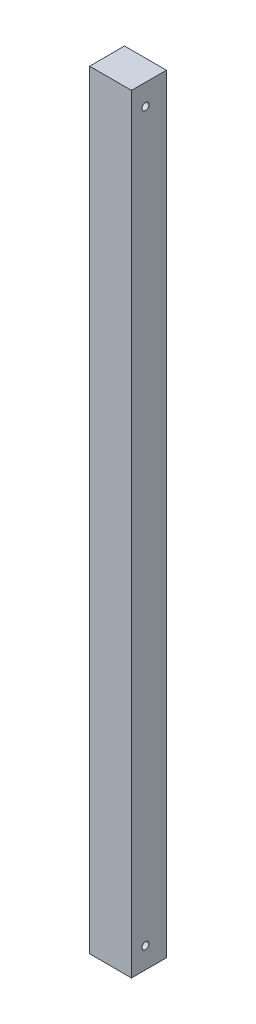
ISO-10303-21;
HEADER;
FILE_DESCRIPTION(('STEP AP214'),'2;1');
FILE_NAME('part.step','',(''),(''),'','','');
FILE_SCHEMA(('AUTOMOTIVE_DESIGN { 1 0 10303 214 1 1 1 1 }'));
ENDSEC;
DATA;
#1=APPLICATION_CONTEXT('core data for automotive mechanical design processes');
#2=APPLICATION_PROTOCOL_DEFINITION('international standard','automotive_design',2000,#1);
#3=PRODUCT_CONTEXT('',#1,'mechanical');
#4=PRODUCT('Part','Part','',(#3));
#5=PRODUCT_RELATED_PRODUCT_CATEGORY('part','',(#4));
#6=PRODUCT_DEFINITION_FORMATION('','',#4);
#7=PRODUCT_DEFINITION_CONTEXT('part definition',#1,'design');
#8=PRODUCT_DEFINITION('design','',#6,#7);
#9=PRODUCT_DEFINITION_SHAPE('','',#8);
#10=(LENGTH_UNIT() NAMED_UNIT(*) SI_UNIT(.MILLI.,.METRE.));
#11=(NAMED_UNIT(*) PLANE_ANGLE_UNIT() SI_UNIT($,.RADIAN.));
#12=(NAMED_UNIT(*) SI_UNIT($,.STERADIAN.) SOLID_ANGLE_UNIT());
#13=UNCERTAINTY_MEASURE_WITH_UNIT(LENGTH_MEASURE(1.E-05),#10,'distance_accuracy_value','');
#14=(GEOMETRIC_REPRESENTATION_CONTEXT(3) GLOBAL_UNCERTAINTY_ASSIGNED_CONTEXT((#13)) GLOBAL_UNIT_ASSIGNED_CONTEXT((#10,
#11,#12)) REPRESENTATION_CONTEXT('',''));
#15=CARTESIAN_POINT('',(0.,0.,0.));
#16=DIRECTION('',(0.,0.,1.));
#17=DIRECTION('',(1.,0.,0.));
#18=AXIS2_PLACEMENT_3D('',#15,#16,#17);
#19=CARTESIAN_POINT('',(30.,550.,-5.));
#20=DIRECTION('',(-1.,0.,0.));
#21=DIRECTION('',(0.,0.,1.));
#22=AXIS2_PLACEMENT_3D('',#19,#20,#21);
#23=PLANE('',#22);
#24=CARTESIAN_POINT('',(30.,15.,-15.));
#25=DIRECTION('',(1.,0.,0.));
#26=DIRECTION('',(0.,0.,-1.));
#27=AXIS2_PLACEMENT_3D('',#24,#25,#26);
#28=CIRCLE('',#27,2.5);
#29=CARTESIAN_POINT('',(30.,15.,-17.5));
#30=VERTEX_POINT('',#29);
#31=EDGE_CURVE('E119',#30,#30,#28,.T.);
#32=ORIENTED_EDGE('',*,*,#31,.F.);
#33=EDGE_LOOP('',(#32));
#34=FACE_BOUND('',#33,.T.);
#35=CARTESIAN_POINT('',(30.,535.,-15.));
#36=DIRECTION('',(1.,0.,0.));
#37=DIRECTION('',(0.,0.,1.));
#38=AXIS2_PLACEMENT_3D('',#35,#36,#37);
#39=CIRCLE('',#38,2.5);
#40=CARTESIAN_POINT('',(30.,535.,-12.5));
#41=VERTEX_POINT('',#40);
#42=EDGE_CURVE('E113',#41,#41,#39,.T.);
#43=ORIENTED_EDGE('',*,*,#42,.F.);
#44=EDGE_LOOP('',(#43));
#45=FACE_BOUND('',#44,.T.);
#46=DIRECTION('',(0.,0.,-1.));
#47=VECTOR('',#46,1.);
#48=CARTESIAN_POINT('',(30.,0.,-5.));
#49=LINE('',#48,#47);
#50=CARTESIAN_POINT('',(30.,0.,-5.));
#51=VERTEX_POINT('',#50);
#52=CARTESIAN_POINT('',(30.,0.,-30.));
#53=VERTEX_POINT('',#52);
#54=EDGE_CURVE('E99',#51,#53,#49,.T.);
#55=ORIENTED_EDGE('',*,*,#54,.T.);
#56=DIRECTION('',(0.,-1.,0.));
#57=VECTOR('',#56,1.);
#58=CARTESIAN_POINT('',(30.,550.,-30.));
#59=LINE('',#58,#57);
#60=CARTESIAN_POINT('',(30.,550.,-30.));
#61=VERTEX_POINT('',#60);
#62=EDGE_CURVE('E11',#61,#53,#59,.T.);
#63=ORIENTED_EDGE('',*,*,#62,.F.);
#64=DIRECTION('',(0.,0.,-1.));
#65=VECTOR('',#64,1.);
#66=CARTESIAN_POINT('',(30.,550.,-5.));
#67=LINE('',#66,#65);
#68=CARTESIAN_POINT('',(30.,550.,-5.));
#69=VERTEX_POINT('',#68);
#70=EDGE_CURVE('E87',#69,#61,#67,.T.);
#71=ORIENTED_EDGE('',*,*,#70,.F.);
#72=DIRECTION('',(0.,-1.,0.));
#73=VECTOR('',#72,1.);
#74=CARTESIAN_POINT('',(30.,550.,-5.));
#75=LINE('',#74,#73);
#76=EDGE_CURVE('E95',#69,#51,#75,.T.);
#77=ORIENTED_EDGE('',*,*,#76,.T.);
#78=EDGE_LOOP('',(#55,#63,#71,#77));
#79=FACE_BOUND('',#78,.T.);
#80=ADVANCED_FACE('F36',(#34,#45,#79),#23,.F.);
#81=CARTESIAN_POINT('',(0.,550.,-30.));
#82=DIRECTION('',(0.,0.,1.));
#83=DIRECTION('',(1.,0.,0.));
#84=AXIS2_PLACEMENT_3D('',#81,#82,#83);
#85=PLANE('',#84);
#86=DIRECTION('',(-1.,0.,0.));
#87=VECTOR('',#86,1.);
#88=CARTESIAN_POINT('',(0.,0.,-30.));
#89=LINE('',#88,#87);
#90=CARTESIAN_POINT('',(0.,0.,-30.));
#91=VERTEX_POINT('',#90);
#92=EDGE_CURVE('E91',#53,#91,#89,.T.);
#93=ORIENTED_EDGE('',*,*,#92,.T.);
#94=DIRECTION('',(0.,-1.,0.));
#95=VECTOR('',#94,1.);
#96=CARTESIAN_POINT('',(0.,550.,-30.));
#97=LINE('',#96,#95);
#98=CARTESIAN_POINT('',(0.,550.,-30.));
#99=VERTEX_POINT('',#98);
#100=EDGE_CURVE('E44',#99,#91,#97,.T.);
#101=ORIENTED_EDGE('',*,*,#100,.F.);
#102=DIRECTION('',(-1.,0.,0.));
#103=VECTOR('',#102,1.);
#104=CARTESIAN_POINT('',(0.,550.,-30.));
#105=LINE('',#104,#103);
#106=EDGE_CURVE('E82',#61,#99,#105,.T.);
#107=ORIENTED_EDGE('',*,*,#106,.F.);
#108=ORIENTED_EDGE('',*,*,#62,.T.);
#109=EDGE_LOOP('',(#93,#101,#107,#108));
#110=FACE_BOUND('',#109,.T.);
#111=ADVANCED_FACE('F90',(#110),#85,.F.);
#112=CARTESIAN_POINT('',(0.,550.,-5.));
#113=DIRECTION('',(1.,0.,0.));
#114=DIRECTION('',(0.,0.,-1.));
#115=AXIS2_PLACEMENT_3D('',#112,#113,#114);
#116=PLANE('',#115);
#117=CARTESIAN_POINT('',(0.,15.,-15.));
#118=DIRECTION('',(1.,0.,0.));
#119=DIRECTION('',(0.,0.,-1.));
#120=AXIS2_PLACEMENT_3D('',#117,#118,#119);
#121=CIRCLE('',#120,2.5);
#122=CARTESIAN_POINT('',(0.,15.,-17.5));
#123=VERTEX_POINT('',#122);
#124=EDGE_CURVE('E102',#123,#123,#121,.T.);
#125=ORIENTED_EDGE('',*,*,#124,.T.);
#126=EDGE_LOOP('',(#125));
#127=FACE_BOUND('',#126,.T.);
#128=CARTESIAN_POINT('',(0.,535.,-15.));
#129=DIRECTION('',(1.,0.,0.));
#130=DIRECTION('',(0.,0.,1.));
#131=AXIS2_PLACEMENT_3D('',#128,#129,#130);
#132=CIRCLE('',#131,2.5);
#133=CARTESIAN_POINT('',(0.,535.,-12.5));
#134=VERTEX_POINT('',#133);
#135=EDGE_CURVE('E116',#134,#134,#132,.T.);
#136=ORIENTED_EDGE('',*,*,#135,.T.);
#137=EDGE_LOOP('',(#136));
#138=FACE_BOUND('',#137,.T.);
#139=DIRECTION('',(0.,0.,1.));
#140=VECTOR('',#139,1.);
#141=CARTESIAN_POINT('',(0.,0.,-5.));
#142=LINE('',#141,#140);
#143=CARTESIAN_POINT('',(0.,0.,-5.));
#144=VERTEX_POINT('',#143);
#145=EDGE_CURVE('E69',#91,#144,#142,.T.);
#146=ORIENTED_EDGE('',*,*,#145,.T.);
#147=DIRECTION('',(0.,-1.,0.));
#148=VECTOR('',#147,1.);
#149=CARTESIAN_POINT('',(0.,550.,-5.));
#150=LINE('',#149,#148);
#151=CARTESIAN_POINT('',(0.,550.,-5.));
#152=VERTEX_POINT('',#151);
#153=EDGE_CURVE('E92',#152,#144,#150,.T.);
#154=ORIENTED_EDGE('',*,*,#153,.F.);
#155=DIRECTION('',(0.,0.,1.));
#156=VECTOR('',#155,1.);
#157=CARTESIAN_POINT('',(0.,550.,-5.));
#158=LINE('',#157,#156);
#159=EDGE_CURVE('E85',#99,#152,#158,.T.);
#160=ORIENTED_EDGE('',*,*,#159,.F.);
#161=ORIENTED_EDGE('',*,*,#100,.T.);
#162=EDGE_LOOP('',(#146,#154,#160,#161));
#163=FACE_BOUND('',#162,.T.);
#164=ADVANCED_FACE('F93',(#127,#138,#163),#116,.F.);
#165=CARTESIAN_POINT('',(0.,550.,-5.));
#166=DIRECTION('',(0.,0.,-1.));
#167=DIRECTION('',(-1.,0.,0.));
#168=AXIS2_PLACEMENT_3D('',#165,#166,#167);
#169=PLANE('',#168);
#170=DIRECTION('',(1.,0.,0.));
#171=VECTOR('',#170,1.);
#172=CARTESIAN_POINT('',(0.,0.,-5.));
#173=LINE('',#172,#171);
#174=EDGE_CURVE('E75',#144,#51,#173,.T.);
#175=ORIENTED_EDGE('',*,*,#174,.T.);
#176=ORIENTED_EDGE('',*,*,#76,.F.);
#177=DIRECTION('',(1.,0.,0.));
#178=VECTOR('',#177,1.);
#179=CARTESIAN_POINT('',(0.,550.,-5.));
#180=LINE('',#179,#178);
#181=EDGE_CURVE('E52',#152,#69,#180,.T.);
#182=ORIENTED_EDGE('',*,*,#181,.F.);
#183=ORIENTED_EDGE('',*,*,#153,.T.);
#184=EDGE_LOOP('',(#175,#176,#182,#183));
#185=FACE_BOUND('',#184,.T.);
#186=ADVANCED_FACE('F107',(#185),#169,.F.);
#187=CARTESIAN_POINT('',(0.,550.,0.));
#188=DIRECTION('',(0.,-1.,0.));
#189=DIRECTION('',(0.,0.,-1.));
#190=AXIS2_PLACEMENT_3D('',#187,#188,#189);
#191=PLANE('',#190);
#192=ORIENTED_EDGE('',*,*,#70,.T.);
#193=ORIENTED_EDGE('',*,*,#106,.T.);
#194=ORIENTED_EDGE('',*,*,#159,.T.);
#195=ORIENTED_EDGE('',*,*,#181,.T.);
#196=EDGE_LOOP('',(#192,#193,#194,#195));
#197=FACE_BOUND('',#196,.T.);
#198=ADVANCED_FACE('F83',(#197),#191,.F.);
#199=CARTESIAN_POINT('',(0.,0.,0.));
#200=DIRECTION('',(0.,-1.,0.));
#201=DIRECTION('',(0.,0.,-1.));
#202=AXIS2_PLACEMENT_3D('',#199,#200,#201);
#203=PLANE('',#202);
#204=ORIENTED_EDGE('',*,*,#54,.F.);
#205=ORIENTED_EDGE('',*,*,#174,.F.);
#206=ORIENTED_EDGE('',*,*,#145,.F.);
#207=ORIENTED_EDGE('',*,*,#92,.F.);
#208=EDGE_LOOP('',(#204,#205,#206,#207));
#209=FACE_BOUND('',#208,.T.);
#210=ADVANCED_FACE('F110',(#209),#203,.T.);
#211=CARTESIAN_POINT('',(0.,535.,-15.));
#212=DIRECTION('',(1.,0.,0.));
#213=DIRECTION('',(0.,0.,-1.));
#214=AXIS2_PLACEMENT_3D('',#211,#212,#213);
#215=CYLINDRICAL_SURFACE('',#214,2.5);
#216=ORIENTED_EDGE('',*,*,#135,.F.);
#217=EDGE_LOOP('',(#216));
#218=FACE_BOUND('',#217,.T.);
#219=ORIENTED_EDGE('',*,*,#42,.T.);
#220=EDGE_LOOP('',(#219));
#221=FACE_BOUND('',#220,.T.);
#222=ADVANCED_FACE('F130',(#218,#221),#215,.F.);
#223=CARTESIAN_POINT('',(0.,15.,-15.));
#224=DIRECTION('',(1.,0.,0.));
#225=DIRECTION('',(0.,0.,-1.));
#226=AXIS2_PLACEMENT_3D('',#223,#224,#225);
#227=CYLINDRICAL_SURFACE('',#226,2.5);
#228=ORIENTED_EDGE('',*,*,#124,.F.);
#229=EDGE_LOOP('',(#228));
#230=FACE_BOUND('',#229,.T.);
#231=ORIENTED_EDGE('',*,*,#31,.T.);
#232=EDGE_LOOP('',(#231));
#233=FACE_BOUND('',#232,.T.);
#234=ADVANCED_FACE('F127',(#230,#233),#227,.F.);
#235=CLOSED_SHELL('',(#80,#111,#164,#186,#198,#210,#222,#234));
#236=MANIFOLD_SOLID_BREP('B2',#235);
#237=ADVANCED_BREP_SHAPE_REPRESENTATION('',(#18,#236),#14);
#238=SHAPE_DEFINITION_REPRESENTATION(#9,#237);
ENDSEC;
END-ISO-10303-21;
